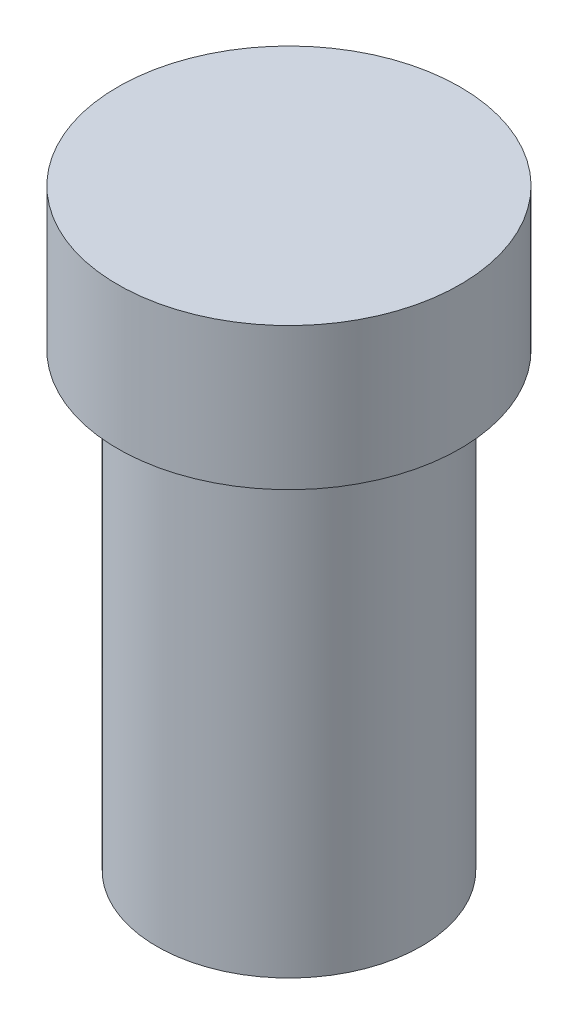
ISO-10303-21;
HEADER;
FILE_DESCRIPTION(('STEP AP214'),'2;1');
FILE_NAME('part.step','',(''),(''),'','','');
FILE_SCHEMA(('AUTOMOTIVE_DESIGN { 1 0 10303 214 1 1 1 1 }'));
ENDSEC;
DATA;
#1=APPLICATION_CONTEXT('core data for automotive mechanical design processes');
#2=APPLICATION_PROTOCOL_DEFINITION('international standard','automotive_design',2000,#1);
#3=PRODUCT_CONTEXT('',#1,'mechanical');
#4=PRODUCT('Part','Part','',(#3));
#5=PRODUCT_RELATED_PRODUCT_CATEGORY('part','',(#4));
#6=PRODUCT_DEFINITION_FORMATION('','',#4);
#7=PRODUCT_DEFINITION_CONTEXT('part definition',#1,'design');
#8=PRODUCT_DEFINITION('design','',#6,#7);
#9=PRODUCT_DEFINITION_SHAPE('','',#8);
#10=(LENGTH_UNIT() NAMED_UNIT(*) SI_UNIT(.MILLI.,.METRE.));
#11=(NAMED_UNIT(*) PLANE_ANGLE_UNIT() SI_UNIT($,.RADIAN.));
#12=(NAMED_UNIT(*) SI_UNIT($,.STERADIAN.) SOLID_ANGLE_UNIT());
#13=UNCERTAINTY_MEASURE_WITH_UNIT(LENGTH_MEASURE(1.E-05),#10,'distance_accuracy_value','');
#14=(GEOMETRIC_REPRESENTATION_CONTEXT(3) GLOBAL_UNCERTAINTY_ASSIGNED_CONTEXT((#13)) GLOBAL_UNIT_ASSIGNED_CONTEXT((#10,
#11,#12)) REPRESENTATION_CONTEXT('',''));
#15=CARTESIAN_POINT('',(0.,0.,0.));
#16=DIRECTION('',(0.,0.,1.));
#17=DIRECTION('',(1.,0.,0.));
#18=AXIS2_PLACEMENT_3D('',#15,#16,#17);
#19=CARTESIAN_POINT('',(0.,0.,0.));
#20=DIRECTION('',(0.,-1.,0.));
#21=DIRECTION('',(0.,0.,-1.));
#22=AXIS2_PLACEMENT_3D('',#19,#20,#21);
#23=PLANE('',#22);
#24=CARTESIAN_POINT('',(0.,0.,0.));
#25=DIRECTION('',(0.,-1.,0.));
#26=DIRECTION('',(0.,0.,-1.));
#27=AXIS2_PLACEMENT_3D('',#24,#25,#26);
#28=CIRCLE('',#27,22.);
#29=CARTESIAN_POINT('',(0.,0.,-22.));
#30=VERTEX_POINT('',#29);
#31=EDGE_CURVE('E42',#30,#30,#28,.T.);
#32=ORIENTED_EDGE('',*,*,#31,.T.);
#33=EDGE_LOOP('',(#32));
#34=FACE_BOUND('',#33,.T.);
#35=ADVANCED_FACE('F31',(#34),#23,.T.);
#36=CARTESIAN_POINT('',(0.,0.,0.));
#37=DIRECTION('',(0.,-1.,0.));
#38=DIRECTION('',(0.,0.,-1.));
#39=AXIS2_PLACEMENT_3D('',#36,#37,#38);
#40=CYLINDRICAL_SURFACE('',#39,22.);
#41=CARTESIAN_POINT('',(0.,71.,0.));
#42=DIRECTION('',(0.,-1.,0.));
#43=DIRECTION('',(0.,0.,-1.));
#44=AXIS2_PLACEMENT_3D('',#41,#42,#43);
#45=CIRCLE('',#44,22.);
#46=CARTESIAN_POINT('',(0.,71.,-22.));
#47=VERTEX_POINT('',#46);
#48=EDGE_CURVE('E38',#47,#47,#45,.T.);
#49=ORIENTED_EDGE('',*,*,#48,.T.);
#50=EDGE_LOOP('',(#49));
#51=FACE_BOUND('',#50,.T.);
#52=ORIENTED_EDGE('',*,*,#31,.F.);
#53=EDGE_LOOP('',(#52));
#54=FACE_BOUND('',#53,.T.);
#55=ADVANCED_FACE('F69',(#51,#54),#40,.T.);
#56=CARTESIAN_POINT('',(22.,75.,0.));
#57=DIRECTION('',(0.,-1.,0.));
#58=DIRECTION('',(0.,0.,-1.));
#59=AXIS2_PLACEMENT_3D('',#56,#57,#58);
#60=PLANE('',#59);
#61=CARTESIAN_POINT('',(0.,75.,0.));
#62=DIRECTION('',(0.,-1.,0.));
#63=DIRECTION('',(0.,0.,-1.));
#64=AXIS2_PLACEMENT_3D('',#61,#62,#63);
#65=CIRCLE('',#64,26.);
#66=CARTESIAN_POINT('',(0.,75.,-26.));
#67=VERTEX_POINT('',#66);
#68=EDGE_CURVE('E10',#67,#67,#65,.F.);
#69=ORIENTED_EDGE('',*,*,#68,.T.);
#70=EDGE_LOOP('',(#69));
#71=FACE_BOUND('',#70,.T.);
#72=CARTESIAN_POINT('',(0.,75.,0.));
#73=DIRECTION('',(0.,-1.,0.));
#74=DIRECTION('',(0.,0.,-1.));
#75=AXIS2_PLACEMENT_3D('',#72,#73,#74);
#76=CIRCLE('',#75,28.5);
#77=CARTESIAN_POINT('',(0.,75.,-28.5));
#78=VERTEX_POINT('',#77);
#79=EDGE_CURVE('E46',#78,#78,#76,.T.);
#80=ORIENTED_EDGE('',*,*,#79,.T.);
#81=EDGE_LOOP('',(#80));
#82=FACE_BOUND('',#81,.T.);
#83=ADVANCED_FACE('F66',(#71,#82),#60,.T.);
#84=CARTESIAN_POINT('',(0.,0.,0.));
#85=DIRECTION('',(0.,-1.,0.));
#86=DIRECTION('',(0.,0.,-1.));
#87=AXIS2_PLACEMENT_3D('',#84,#85,#86);
#88=CYLINDRICAL_SURFACE('',#87,28.5);
#89=CARTESIAN_POINT('',(0.,98.6593059936909,0.));
#90=DIRECTION('',(0.,-1.,0.));
#91=DIRECTION('',(0.,0.,-1.));
#92=AXIS2_PLACEMENT_3D('',#89,#90,#91);
#93=CIRCLE('',#92,28.5);
#94=CARTESIAN_POINT('',(0.,98.6593059936909,-28.5));
#95=VERTEX_POINT('',#94);
#96=EDGE_CURVE('E51',#95,#95,#93,.T.);
#97=ORIENTED_EDGE('',*,*,#96,.T.);
#98=EDGE_LOOP('',(#97));
#99=FACE_BOUND('',#98,.T.);
#100=ORIENTED_EDGE('',*,*,#79,.F.);
#101=EDGE_LOOP('',(#100));
#102=FACE_BOUND('',#101,.T.);
#103=ADVANCED_FACE('F55',(#99,#102),#88,.T.);
#104=CARTESIAN_POINT('',(28.5,98.6593059936909,0.));
#105=DIRECTION('',(0.,1.,0.));
#106=DIRECTION('',(0.,0.,1.));
#107=AXIS2_PLACEMENT_3D('',#104,#105,#106);
#108=PLANE('',#107);
#109=ORIENTED_EDGE('',*,*,#96,.F.);
#110=EDGE_LOOP('',(#109));
#111=FACE_BOUND('',#110,.T.);
#112=ADVANCED_FACE('F58',(#111),#108,.T.);
#113=CARTESIAN_POINT('',(0.,71.,0.));
#114=DIRECTION('',(0.,-1.,0.));
#115=DIRECTION('',(0.,0.,-1.));
#116=AXIS2_PLACEMENT_3D('',#113,#114,#115);
#117=TOROIDAL_SURFACE('',#116,26.,4.);
#118=ORIENTED_EDGE('',*,*,#68,.F.);
#119=EDGE_LOOP('',(#118));
#120=FACE_BOUND('',#119,.T.);
#121=ORIENTED_EDGE('',*,*,#48,.F.);
#122=EDGE_LOOP('',(#121));
#123=FACE_BOUND('',#122,.T.);
#124=ADVANCED_FACE('F33',(#120,#123),#117,.F.);
#125=CLOSED_SHELL('',(#35,#55,#83,#103,#112,#124));
#126=MANIFOLD_SOLID_BREP('B2',#125);
#127=ADVANCED_BREP_SHAPE_REPRESENTATION('',(#18,#126),#14);
#128=SHAPE_DEFINITION_REPRESENTATION(#9,#127);
ENDSEC;
END-ISO-10303-21;
